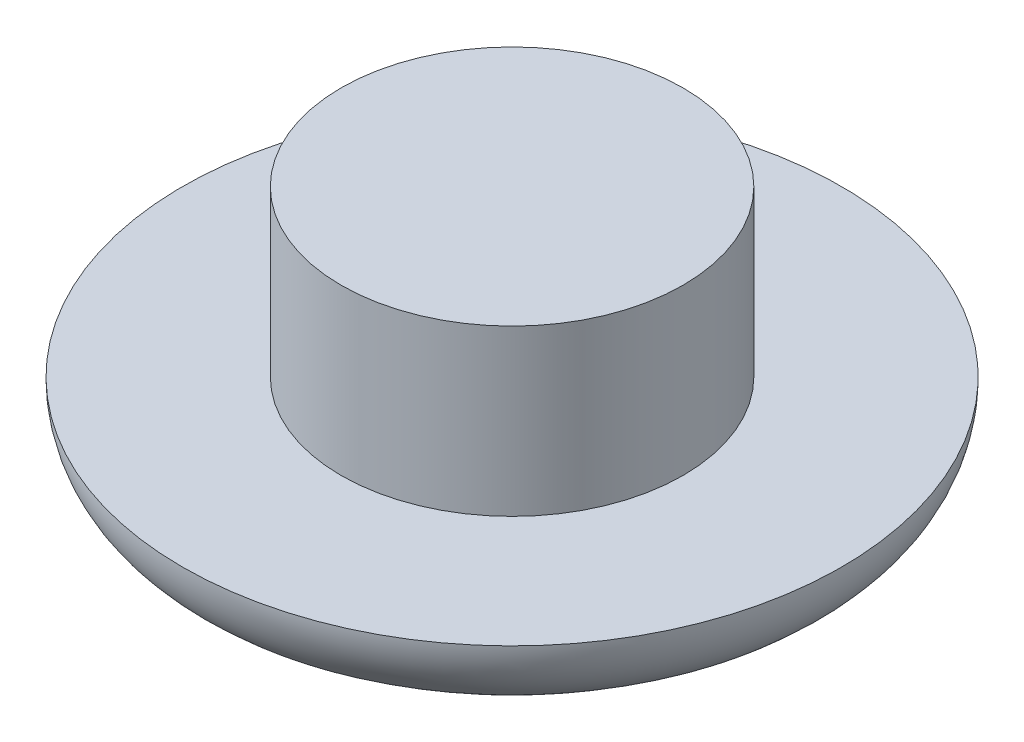
ISO-10303-21;
HEADER;
FILE_DESCRIPTION(('STEP AP214'),'2;1');
FILE_NAME('part.step','',(''),(''),'','','');
FILE_SCHEMA(('AUTOMOTIVE_DESIGN { 1 0 10303 214 1 1 1 1 }'));
ENDSEC;
DATA;
#1=APPLICATION_CONTEXT('core data for automotive mechanical design processes');
#2=APPLICATION_PROTOCOL_DEFINITION('international standard','automotive_design',2000,#1);
#3=PRODUCT_CONTEXT('',#1,'mechanical');
#4=PRODUCT('Part','Part','',(#3));
#5=PRODUCT_RELATED_PRODUCT_CATEGORY('part','',(#4));
#6=PRODUCT_DEFINITION_FORMATION('','',#4);
#7=PRODUCT_DEFINITION_CONTEXT('part definition',#1,'design');
#8=PRODUCT_DEFINITION('design','',#6,#7);
#9=PRODUCT_DEFINITION_SHAPE('','',#8);
#10=(LENGTH_UNIT() NAMED_UNIT(*) SI_UNIT(.MILLI.,.METRE.));
#11=(NAMED_UNIT(*) PLANE_ANGLE_UNIT() SI_UNIT($,.RADIAN.));
#12=(NAMED_UNIT(*) SI_UNIT($,.STERADIAN.) SOLID_ANGLE_UNIT());
#13=UNCERTAINTY_MEASURE_WITH_UNIT(LENGTH_MEASURE(1.E-05),#10,'distance_accuracy_value','');
#14=(GEOMETRIC_REPRESENTATION_CONTEXT(3) GLOBAL_UNCERTAINTY_ASSIGNED_CONTEXT((#13)) GLOBAL_UNIT_ASSIGNED_CONTEXT((#10,
#11,#12)) REPRESENTATION_CONTEXT('',''));
#15=CARTESIAN_POINT('',(0.,0.,0.));
#16=DIRECTION('',(0.,0.,1.));
#17=DIRECTION('',(1.,0.,0.));
#18=AXIS2_PLACEMENT_3D('',#15,#16,#17);
#19=CARTESIAN_POINT('',(0.,-10.,0.));
#20=DIRECTION('',(0.,1.,0.));
#21=DIRECTION('',(0.,0.,1.));
#22=AXIS2_PLACEMENT_3D('',#19,#20,#21);
#23=PLANE('',#22);
#24=CARTESIAN_POINT('',(0.,-10.,0.));
#25=DIRECTION('',(0.,1.,0.));
#26=DIRECTION('',(0.,0.,1.));
#27=AXIS2_PLACEMENT_3D('',#24,#25,#26);
#28=CIRCLE('',#27,30.);
#29=CARTESIAN_POINT('',(0.,-10.,30.));
#30=VERTEX_POINT('',#29);
#31=EDGE_CURVE('E10',#30,#30,#28,.F.);
#32=ORIENTED_EDGE('',*,*,#31,.T.);
#33=EDGE_LOOP('',(#32));
#34=FACE_BOUND('',#33,.T.);
#35=ADVANCED_FACE('F31',(#34),#23,.F.);
#36=CARTESIAN_POINT('',(0.,0.,0.));
#37=DIRECTION('',(0.,1.,0.));
#38=DIRECTION('',(0.,0.,1.));
#39=AXIS2_PLACEMENT_3D('',#36,#37,#38);
#40=PLANE('',#39);
#41=CARTESIAN_POINT('',(0.,0.,0.));
#42=DIRECTION('',(0.,1.,0.));
#43=DIRECTION('',(0.,0.,1.));
#44=AXIS2_PLACEMENT_3D('',#41,#42,#43);
#45=CIRCLE('',#44,20.75);
#46=CARTESIAN_POINT('',(0.,0.,20.75));
#47=VERTEX_POINT('',#46);
#48=EDGE_CURVE('E46',#47,#47,#45,.T.);
#49=ORIENTED_EDGE('',*,*,#48,.F.);
#50=EDGE_LOOP('',(#49));
#51=FACE_BOUND('',#50,.T.);
#52=CARTESIAN_POINT('',(0.,0.,0.));
#53=DIRECTION('',(0.,1.,0.));
#54=DIRECTION('',(0.,0.,1.));
#55=AXIS2_PLACEMENT_3D('',#52,#53,#54);
#56=CIRCLE('',#55,40.);
#57=CARTESIAN_POINT('',(0.,0.,40.));
#58=VERTEX_POINT('',#57);
#59=EDGE_CURVE('E38',#58,#58,#56,.T.);
#60=ORIENTED_EDGE('',*,*,#59,.T.);
#61=EDGE_LOOP('',(#60));
#62=FACE_BOUND('',#61,.T.);
#63=ADVANCED_FACE('F54',(#51,#62),#40,.T.);
#64=CARTESIAN_POINT('',(0.,20.,0.));
#65=DIRECTION('',(0.,-1.,0.));
#66=DIRECTION('',(0.,0.,-1.));
#67=AXIS2_PLACEMENT_3D('',#64,#65,#66);
#68=CYLINDRICAL_SURFACE('',#67,20.75);
#69=CARTESIAN_POINT('',(0.,20.,0.));
#70=DIRECTION('',(0.,1.,0.));
#71=DIRECTION('',(0.,0.,1.));
#72=AXIS2_PLACEMENT_3D('',#69,#70,#71);
#73=CIRCLE('',#72,20.75);
#74=CARTESIAN_POINT('',(0.,20.,20.75));
#75=VERTEX_POINT('',#74);
#76=EDGE_CURVE('E42',#75,#75,#73,.T.);
#77=ORIENTED_EDGE('',*,*,#76,.F.);
#78=EDGE_LOOP('',(#77));
#79=FACE_BOUND('',#78,.T.);
#80=ORIENTED_EDGE('',*,*,#48,.T.);
#81=EDGE_LOOP('',(#80));
#82=FACE_BOUND('',#81,.T.);
#83=ADVANCED_FACE('F52',(#79,#82),#68,.T.);
#84=CARTESIAN_POINT('',(0.,20.,0.));
#85=DIRECTION('',(0.,1.,0.));
#86=DIRECTION('',(0.,0.,1.));
#87=AXIS2_PLACEMENT_3D('',#84,#85,#86);
#88=PLANE('',#87);
#89=ORIENTED_EDGE('',*,*,#76,.T.);
#90=EDGE_LOOP('',(#89));
#91=FACE_BOUND('',#90,.T.);
#92=ADVANCED_FACE('F60',(#91),#88,.T.);
#93=CARTESIAN_POINT('',(0.,0.,0.));
#94=DIRECTION('',(0.,1.,0.));
#95=DIRECTION('',(0.,0.,1.));
#96=AXIS2_PLACEMENT_3D('',#93,#94,#95);
#97=TOROIDAL_SURFACE('',#96,30.,10.);
#98=ORIENTED_EDGE('',*,*,#31,.F.);
#99=EDGE_LOOP('',(#98));
#100=FACE_BOUND('',#99,.T.);
#101=ORIENTED_EDGE('',*,*,#59,.F.);
#102=EDGE_LOOP('',(#101));
#103=FACE_BOUND('',#102,.T.);
#104=ADVANCED_FACE('F33',(#100,#103),#97,.T.);
#105=CLOSED_SHELL('',(#35,#63,#83,#92,#104));
#106=MANIFOLD_SOLID_BREP('B2',#105);
#107=ADVANCED_BREP_SHAPE_REPRESENTATION('',(#18,#106),#14);
#108=SHAPE_DEFINITION_REPRESENTATION(#9,#107);
ENDSEC;
END-ISO-10303-21;
